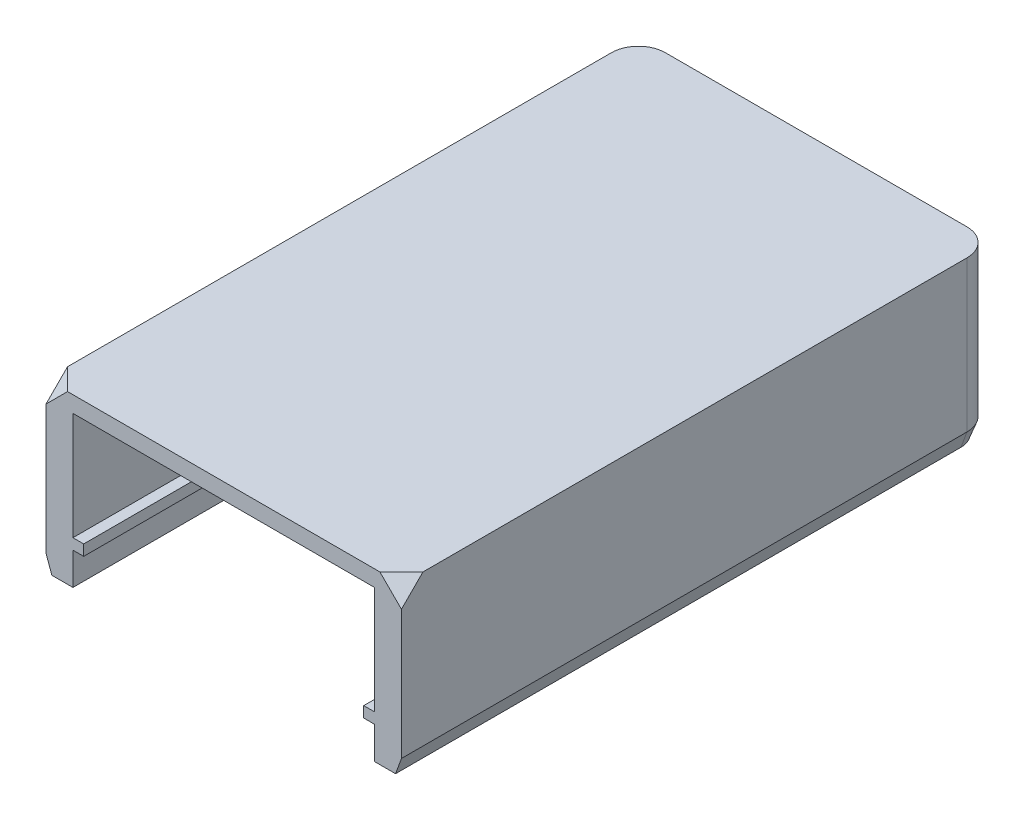
ISO-10303-21;
HEADER;
FILE_DESCRIPTION(('STEP AP214'),'2;1');
FILE_NAME('part.step','',(''),(''),'','','');
FILE_SCHEMA(('AUTOMOTIVE_DESIGN { 1 0 10303 214 1 1 1 1 }'));
ENDSEC;
DATA;
#1=APPLICATION_CONTEXT('core data for automotive mechanical design processes');
#2=APPLICATION_PROTOCOL_DEFINITION('international standard','automotive_design',2000,#1);
#3=PRODUCT_CONTEXT('',#1,'mechanical');
#4=PRODUCT('Part','Part','',(#3));
#5=PRODUCT_RELATED_PRODUCT_CATEGORY('part','',(#4));
#6=PRODUCT_DEFINITION_FORMATION('','',#4);
#7=PRODUCT_DEFINITION_CONTEXT('part definition',#1,'design');
#8=PRODUCT_DEFINITION('design','',#6,#7);
#9=PRODUCT_DEFINITION_SHAPE('','',#8);
#10=(LENGTH_UNIT() NAMED_UNIT(*) SI_UNIT(.MILLI.,.METRE.));
#11=(NAMED_UNIT(*) PLANE_ANGLE_UNIT() SI_UNIT($,.RADIAN.));
#12=(NAMED_UNIT(*) SI_UNIT($,.STERADIAN.) SOLID_ANGLE_UNIT());
#13=UNCERTAINTY_MEASURE_WITH_UNIT(LENGTH_MEASURE(1.E-05),#10,'distance_accuracy_value','');
#14=(GEOMETRIC_REPRESENTATION_CONTEXT(3) GLOBAL_UNCERTAINTY_ASSIGNED_CONTEXT((#13)) GLOBAL_UNIT_ASSIGNED_CONTEXT((#10,
#11,#12)) REPRESENTATION_CONTEXT('',''));
#15=CARTESIAN_POINT('',(0.,0.,0.));
#16=DIRECTION('',(0.,0.,1.));
#17=DIRECTION('',(1.,0.,0.));
#18=AXIS2_PLACEMENT_3D('',#15,#16,#17);
#19=CARTESIAN_POINT('',(28.,-28.,0.));
#20=DIRECTION('',(1.,0.,0.));
#21=DIRECTION('',(0.,0.,-1.));
#22=AXIS2_PLACEMENT_3D('',#19,#20,#21);
#23=PLANE('',#22);
#24=DIRECTION('',(0.,1.,0.));
#25=VECTOR('',#24,1.);
#26=CARTESIAN_POINT('',(28.,-28.,-52.));
#27=LINE('',#26,#25);
#28=CARTESIAN_POINT('',(28.,-20.,-52.));
#29=VERTEX_POINT('',#28);
#30=CARTESIAN_POINT('',(28.,0.,-52.));
#31=VERTEX_POINT('',#30);
#32=EDGE_CURVE('E338',#29,#31,#27,.T.);
#33=ORIENTED_EDGE('',*,*,#32,.F.);
#34=DIRECTION('',(0.,0.,1.));
#35=VECTOR('',#34,1.);
#36=CARTESIAN_POINT('',(28.,-20.,55.));
#37=LINE('',#36,#35);
#38=CARTESIAN_POINT('',(28.,-20.,55.));
#39=VERTEX_POINT('',#38);
#40=EDGE_CURVE('E231',#29,#39,#37,.T.);
#41=ORIENTED_EDGE('',*,*,#40,.T.);
#42=DIRECTION('',(0.,1.,0.));
#43=VECTOR('',#42,1.);
#44=CARTESIAN_POINT('',(28.,-28.,55.));
#45=LINE('',#44,#43);
#46=CARTESIAN_POINT('',(28.,0.,55.));
#47=VERTEX_POINT('',#46);
#48=EDGE_CURVE('E333',#39,#47,#45,.T.);
#49=ORIENTED_EDGE('',*,*,#48,.T.);
#50=DIRECTION('',(0.,0.,-1.));
#51=VECTOR('',#50,1.);
#52=CARTESIAN_POINT('',(28.,0.,0.));
#53=LINE('',#52,#51);
#54=EDGE_CURVE('E339',#47,#31,#53,.T.);
#55=ORIENTED_EDGE('',*,*,#54,.T.);
#56=EDGE_LOOP('',(#33,#41,#49,#55));
#57=FACE_BOUND('',#56,.T.);
#58=ADVANCED_FACE('F44',(#57),#23,.F.);
#59=CARTESIAN_POINT('',(0.,-28.,-52.));
#60=DIRECTION('',(0.,0.,1.));
#61=DIRECTION('',(1.,0.,0.));
#62=AXIS2_PLACEMENT_3D('',#59,#60,#61);
#63=PLANE('',#62);
#64=DIRECTION('',(1.,0.,0.));
#65=VECTOR('',#64,1.);
#66=CARTESIAN_POINT('',(26.,-20.,-52.));
#67=LINE('',#66,#65);
#68=CARTESIAN_POINT('',(26.,-20.,-52.));
#69=VERTEX_POINT('',#68);
#70=EDGE_CURVE('E403',#69,#29,#67,.T.);
#71=ORIENTED_EDGE('',*,*,#70,.T.);
#72=ORIENTED_EDGE('',*,*,#32,.T.);
#73=DIRECTION('',(1.,0.,0.));
#74=VECTOR('',#73,1.);
#75=CARTESIAN_POINT('',(0.,0.,-52.));
#76=LINE('',#75,#74);
#77=CARTESIAN_POINT('',(-28.,0.,-52.));
#78=VERTEX_POINT('',#77);
#79=EDGE_CURVE('E348',#78,#31,#76,.T.);
#80=ORIENTED_EDGE('',*,*,#79,.F.);
#81=DIRECTION('',(0.,1.,0.));
#82=VECTOR('',#81,1.);
#83=CARTESIAN_POINT('',(-28.,-28.,-52.));
#84=LINE('',#83,#82);
#85=CARTESIAN_POINT('',(-28.,-20.,-52.));
#86=VERTEX_POINT('',#85);
#87=EDGE_CURVE('E323',#86,#78,#84,.T.);
#88=ORIENTED_EDGE('',*,*,#87,.F.);
#89=DIRECTION('',(-1.,0.,0.));
#90=VECTOR('',#89,1.);
#91=CARTESIAN_POINT('',(-26.,-20.,-52.));
#92=LINE('',#91,#90);
#93=CARTESIAN_POINT('',(-26.,-20.,-52.));
#94=VERTEX_POINT('',#93);
#95=EDGE_CURVE('E374',#94,#86,#92,.T.);
#96=ORIENTED_EDGE('',*,*,#95,.F.);
#97=DIRECTION('',(0.,1.,0.));
#98=VECTOR('',#97,1.);
#99=CARTESIAN_POINT('',(-26.,-22.,-52.));
#100=LINE('',#99,#98);
#101=CARTESIAN_POINT('',(-26.,-22.,-52.));
#102=VERTEX_POINT('',#101);
#103=EDGE_CURVE('E392',#102,#94,#100,.T.);
#104=ORIENTED_EDGE('',*,*,#103,.F.);
#105=DIRECTION('',(-1.,0.,0.));
#106=VECTOR('',#105,1.);
#107=CARTESIAN_POINT('',(-26.,-22.,-52.));
#108=LINE('',#107,#106);
#109=CARTESIAN_POINT('',(-28.,-22.,-52.));
#110=VERTEX_POINT('',#109);
#111=EDGE_CURVE('E370',#102,#110,#108,.T.);
#112=ORIENTED_EDGE('',*,*,#111,.T.);
#113=CARTESIAN_POINT('',(-28.,-28.,-52.));
#114=VERTEX_POINT('',#113);
#115=EDGE_CURVE('E310',#114,#110,#84,.T.);
#116=ORIENTED_EDGE('',*,*,#115,.F.);
#117=DIRECTION('',(1.,0.,0.));
#118=VECTOR('',#117,1.);
#119=CARTESIAN_POINT('',(0.,-28.,-52.));
#120=LINE('',#119,#118);
#121=CARTESIAN_POINT('',(28.,-28.,-52.));
#122=VERTEX_POINT('',#121);
#123=EDGE_CURVE('E343',#114,#122,#120,.T.);
#124=ORIENTED_EDGE('',*,*,#123,.T.);
#125=CARTESIAN_POINT('',(28.,-22.,-52.));
#126=VERTEX_POINT('',#125);
#127=EDGE_CURVE('E334',#122,#126,#27,.T.);
#128=ORIENTED_EDGE('',*,*,#127,.T.);
#129=DIRECTION('',(1.,0.,0.));
#130=VECTOR('',#129,1.);
#131=CARTESIAN_POINT('',(26.,-22.,-52.));
#132=LINE('',#131,#130);
#133=CARTESIAN_POINT('',(26.,-22.,-52.));
#134=VERTEX_POINT('',#133);
#135=EDGE_CURVE('E407',#134,#126,#132,.T.);
#136=ORIENTED_EDGE('',*,*,#135,.F.);
#137=DIRECTION('',(0.,1.,0.));
#138=VECTOR('',#137,1.);
#139=CARTESIAN_POINT('',(26.,-22.,-52.));
#140=LINE('',#139,#138);
#141=EDGE_CURVE('E425',#134,#69,#140,.T.);
#142=ORIENTED_EDGE('',*,*,#141,.T.);
#143=EDGE_LOOP('',(#71,#72,#80,#88,#96,#104,#112,#116,#124,#128,#136,#142));
#144=FACE_BOUND('',#143,.T.);
#145=ADVANCED_FACE('F447',(#144),#63,.T.);
#146=CARTESIAN_POINT('',(-28.,-28.,0.));
#147=DIRECTION('',(1.,0.,0.));
#148=DIRECTION('',(0.,0.,-1.));
#149=AXIS2_PLACEMENT_3D('',#146,#147,#148);
#150=PLANE('',#149);
#151=ORIENTED_EDGE('',*,*,#115,.T.);
#152=DIRECTION('',(0.,0.,-1.));
#153=VECTOR('',#152,1.);
#154=CARTESIAN_POINT('',(-28.,-22.,55.));
#155=LINE('',#154,#153);
#156=CARTESIAN_POINT('',(-28.,-22.,55.));
#157=VERTEX_POINT('',#156);
#158=EDGE_CURVE('E386',#157,#110,#155,.T.);
#159=ORIENTED_EDGE('',*,*,#158,.F.);
#160=DIRECTION('',(0.,1.,0.));
#161=VECTOR('',#160,1.);
#162=CARTESIAN_POINT('',(-28.,-28.,55.));
#163=LINE('',#162,#161);
#164=CARTESIAN_POINT('',(-28.,-28.,55.));
#165=VERTEX_POINT('',#164);
#166=EDGE_CURVE('E324',#165,#157,#163,.T.);
#167=ORIENTED_EDGE('',*,*,#166,.F.);
#168=DIRECTION('',(0.,0.,-1.));
#169=VECTOR('',#168,1.);
#170=CARTESIAN_POINT('',(-28.,-28.,0.));
#171=LINE('',#170,#169);
#172=EDGE_CURVE('E361',#165,#114,#171,.T.);
#173=ORIENTED_EDGE('',*,*,#172,.T.);
#174=EDGE_LOOP('',(#151,#159,#167,#173));
#175=FACE_BOUND('',#174,.T.);
#176=ADVANCED_FACE('F503',(#175),#150,.T.);
#177=CARTESIAN_POINT('',(-28.,-20.,55.));
#178=VERTEX_POINT('',#177);
#179=CARTESIAN_POINT('',(-28.,0.,55.));
#180=VERTEX_POINT('',#179);
#181=EDGE_CURVE('E328',#178,#180,#163,.T.);
#182=ORIENTED_EDGE('',*,*,#181,.F.);
#183=DIRECTION('',(0.,0.,1.));
#184=VECTOR('',#183,1.);
#185=CARTESIAN_POINT('',(-28.,-20.,55.));
#186=LINE('',#185,#184);
#187=EDGE_CURVE('E382',#86,#178,#186,.T.);
#188=ORIENTED_EDGE('',*,*,#187,.F.);
#189=ORIENTED_EDGE('',*,*,#87,.T.);
#190=DIRECTION('',(0.,0.,-1.));
#191=VECTOR('',#190,1.);
#192=CARTESIAN_POINT('',(-28.,0.,0.));
#193=LINE('',#192,#191);
#194=EDGE_CURVE('E344',#180,#78,#193,.T.);
#195=ORIENTED_EDGE('',*,*,#194,.F.);
#196=EDGE_LOOP('',(#182,#188,#189,#195));
#197=FACE_BOUND('',#196,.T.);
#198=ADVANCED_FACE('F522',(#197),#150,.T.);
#199=CARTESIAN_POINT('',(33.,3.,55.));
#200=DIRECTION('',(-1.,0.,0.));
#201=DIRECTION('',(0.,0.,1.));
#202=AXIS2_PLACEMENT_3D('',#199,#200,#201);
#203=PLANE('',#202);
#204=DIRECTION('',(0.,0.707106781186548,-0.707106781186547));
#205=VECTOR('',#204,1.);
#206=CARTESIAN_POINT('',(33.,1.,53.));
#207=LINE('',#206,#205);
#208=CARTESIAN_POINT('',(33.,-1.,55.));
#209=VERTEX_POINT('',#208);
#210=CARTESIAN_POINT('',(33.,3.,51.));
#211=VERTEX_POINT('',#210);
#212=EDGE_CURVE('E66',#209,#211,#207,.T.);
#213=ORIENTED_EDGE('',*,*,#212,.F.);
#214=DIRECTION('',(0.,-1.,0.));
#215=VECTOR('',#214,1.);
#216=CARTESIAN_POINT('',(33.,3.,55.));
#217=LINE('',#216,#215);
#218=CARTESIAN_POINT('',(33.,-25.,55.));
#219=VERTEX_POINT('',#218);
#220=EDGE_CURVE('E205',#209,#219,#217,.T.);
#221=ORIENTED_EDGE('',*,*,#220,.T.);
#222=DIRECTION('',(0.,0.,-1.));
#223=VECTOR('',#222,1.);
#224=CARTESIAN_POINT('',(33.,-25.,-50.));
#225=LINE('',#224,#223);
#226=CARTESIAN_POINT('',(33.,-25.,-50.));
#227=VERTEX_POINT('',#226);
#228=EDGE_CURVE('E226',#219,#227,#225,.T.);
#229=ORIENTED_EDGE('',*,*,#228,.T.);
#230=DIRECTION('',(0.,-1.,0.));
#231=VECTOR('',#230,1.);
#232=CARTESIAN_POINT('',(33.,3.,-50.));
#233=LINE('',#232,#231);
#234=CARTESIAN_POINT('',(33.,3.,-50.));
#235=VERTEX_POINT('',#234);
#236=EDGE_CURVE('E280',#227,#235,#233,.F.);
#237=ORIENTED_EDGE('',*,*,#236,.T.);
#238=DIRECTION('',(0.,0.,-1.));
#239=VECTOR('',#238,1.);
#240=CARTESIAN_POINT('',(33.,3.,55.));
#241=LINE('',#240,#239);
#242=EDGE_CURVE('E309',#211,#235,#241,.T.);
#243=ORIENTED_EDGE('',*,*,#242,.F.);
#244=EDGE_LOOP('',(#213,#221,#229,#237,#243));
#245=FACE_BOUND('',#244,.T.);
#246=ADVANCED_FACE('F463',(#245),#203,.F.);
#247=CARTESIAN_POINT('',(-33.,3.,-55.));
#248=DIRECTION('',(0.,0.,1.));
#249=DIRECTION('',(1.,0.,0.));
#250=AXIS2_PLACEMENT_3D('',#247,#248,#249);
#251=PLANE('',#250);
#252=DIRECTION('',(0.,-1.,0.));
#253=VECTOR('',#252,1.);
#254=CARTESIAN_POINT('',(28.,3.,-55.));
#255=LINE('',#254,#253);
#256=CARTESIAN_POINT('',(28.,3.,-55.));
#257=VERTEX_POINT('',#256);
#258=CARTESIAN_POINT('',(28.,-25.,-55.));
#259=VERTEX_POINT('',#258);
#260=EDGE_CURVE('E293',#257,#259,#255,.T.);
#261=ORIENTED_EDGE('',*,*,#260,.T.);
#262=DIRECTION('',(-1.,0.,0.));
#263=VECTOR('',#262,1.);
#264=CARTESIAN_POINT('',(-28.,-25.,-55.));
#265=LINE('',#264,#263);
#266=CARTESIAN_POINT('',(-28.,-25.,-55.));
#267=VERTEX_POINT('',#266);
#268=EDGE_CURVE('E248',#259,#267,#265,.T.);
#269=ORIENTED_EDGE('',*,*,#268,.T.);
#270=DIRECTION('',(0.,-1.,0.));
#271=VECTOR('',#270,1.);
#272=CARTESIAN_POINT('',(-28.,3.,-55.));
#273=LINE('',#272,#271);
#274=CARTESIAN_POINT('',(-28.,3.,-55.));
#275=VERTEX_POINT('',#274);
#276=EDGE_CURVE('E290',#267,#275,#273,.F.);
#277=ORIENTED_EDGE('',*,*,#276,.T.);
#278=DIRECTION('',(-1.,0.,0.));
#279=VECTOR('',#278,1.);
#280=CARTESIAN_POINT('',(-33.,3.,-55.));
#281=LINE('',#280,#279);
#282=EDGE_CURVE('E314',#257,#275,#281,.T.);
#283=ORIENTED_EDGE('',*,*,#282,.F.);
#284=EDGE_LOOP('',(#261,#269,#277,#283));
#285=FACE_BOUND('',#284,.T.);
#286=ADVANCED_FACE('F471',(#285),#251,.F.);
#287=CARTESIAN_POINT('',(-33.,3.,55.));
#288=DIRECTION('',(1.,0.,0.));
#289=DIRECTION('',(0.,0.,-1.));
#290=AXIS2_PLACEMENT_3D('',#287,#288,#289);
#291=PLANE('',#290);
#292=DIRECTION('',(0.,-0.707106781186548,0.707106781186547));
#293=VECTOR('',#292,1.);
#294=CARTESIAN_POINT('',(-33.,1.00000000000001,53.));
#295=LINE('',#294,#293);
#296=CARTESIAN_POINT('',(-33.,3.,51.));
#297=VERTEX_POINT('',#296);
#298=CARTESIAN_POINT('',(-33.,-0.999999999999982,55.));
#299=VERTEX_POINT('',#298);
#300=EDGE_CURVE('E222',#297,#299,#295,.T.);
#301=ORIENTED_EDGE('',*,*,#300,.F.);
#302=DIRECTION('',(0.,0.,1.));
#303=VECTOR('',#302,1.);
#304=CARTESIAN_POINT('',(-33.,3.,55.));
#305=LINE('',#304,#303);
#306=CARTESIAN_POINT('',(-33.,3.,-50.));
#307=VERTEX_POINT('',#306);
#308=EDGE_CURVE('E206',#307,#297,#305,.T.);
#309=ORIENTED_EDGE('',*,*,#308,.F.);
#310=DIRECTION('',(0.,-1.,0.));
#311=VECTOR('',#310,1.);
#312=CARTESIAN_POINT('',(-33.,3.,-50.));
#313=LINE('',#312,#311);
#314=CARTESIAN_POINT('',(-33.,-25.,-50.));
#315=VERTEX_POINT('',#314);
#316=EDGE_CURVE('E297',#307,#315,#313,.T.);
#317=ORIENTED_EDGE('',*,*,#316,.T.);
#318=DIRECTION('',(0.,0.,1.));
#319=VECTOR('',#318,1.);
#320=CARTESIAN_POINT('',(-33.,-25.,55.));
#321=LINE('',#320,#319);
#322=CARTESIAN_POINT('',(-33.,-25.,55.));
#323=VERTEX_POINT('',#322);
#324=EDGE_CURVE('E260',#315,#323,#321,.T.);
#325=ORIENTED_EDGE('',*,*,#324,.T.);
#326=DIRECTION('',(0.,-1.,0.));
#327=VECTOR('',#326,1.);
#328=CARTESIAN_POINT('',(-33.,3.,55.));
#329=LINE('',#328,#327);
#330=EDGE_CURVE('E301',#299,#323,#329,.T.);
#331=ORIENTED_EDGE('',*,*,#330,.F.);
#332=EDGE_LOOP('',(#301,#309,#317,#325,#331));
#333=FACE_BOUND('',#332,.T.);
#334=ADVANCED_FACE('F495',(#333),#291,.F.);
#335=CARTESIAN_POINT('',(-33.,3.,55.));
#336=DIRECTION('',(0.,0.,-1.));
#337=DIRECTION('',(-1.,0.,0.));
#338=AXIS2_PLACEMENT_3D('',#335,#336,#337);
#339=PLANE('',#338);
#340=DIRECTION('',(0.707106781186547,-0.707106781186548,0.));
#341=VECTOR('',#340,1.);
#342=CARTESIAN_POINT('',(-2.,34.,55.));
#343=LINE('',#342,#341);
#344=CARTESIAN_POINT('',(29.,3.,55.));
#345=VERTEX_POINT('',#344);
#346=EDGE_CURVE('E54',#345,#209,#343,.T.);
#347=ORIENTED_EDGE('',*,*,#346,.F.);
#348=DIRECTION('',(1.,0.,0.));
#349=VECTOR('',#348,1.);
#350=CARTESIAN_POINT('',(-33.,3.,55.));
#351=LINE('',#350,#349);
#352=CARTESIAN_POINT('',(-29.,3.,55.));
#353=VERTEX_POINT('',#352);
#354=EDGE_CURVE('E197',#353,#345,#351,.T.);
#355=ORIENTED_EDGE('',*,*,#354,.F.);
#356=DIRECTION('',(0.707106781186547,0.707106781186548,0.));
#357=VECTOR('',#356,1.);
#358=CARTESIAN_POINT('',(-31.,1.00000000000001,55.));
#359=LINE('',#358,#357);
#360=EDGE_CURVE('E217',#299,#353,#359,.T.);
#361=ORIENTED_EDGE('',*,*,#360,.F.);
#362=ORIENTED_EDGE('',*,*,#330,.T.);
#363=DIRECTION('',(0.342020143325667,-0.939692620785909,0.));
#364=VECTOR('',#363,1.);
#365=CARTESIAN_POINT('',(-31.9080892972014,-28.,55.));
#366=LINE('',#365,#364);
#367=CARTESIAN_POINT('',(-31.9080892972014,-28.,55.));
#368=VERTEX_POINT('',#367);
#369=EDGE_CURVE('E254',#323,#368,#366,.T.);
#370=ORIENTED_EDGE('',*,*,#369,.T.);
#371=DIRECTION('',(-1.,0.,0.));
#372=VECTOR('',#371,1.);
#373=CARTESIAN_POINT('',(0.,-28.,55.));
#374=LINE('',#373,#372);
#375=EDGE_CURVE('E357',#165,#368,#374,.T.);
#376=ORIENTED_EDGE('',*,*,#375,.F.);
#377=ORIENTED_EDGE('',*,*,#166,.T.);
#378=DIRECTION('',(-1.,0.,0.));
#379=VECTOR('',#378,1.);
#380=CARTESIAN_POINT('',(-26.,-22.,55.));
#381=LINE('',#380,#379);
#382=CARTESIAN_POINT('',(-26.,-22.,55.));
#383=VERTEX_POINT('',#382);
#384=EDGE_CURVE('E352',#383,#157,#381,.T.);
#385=ORIENTED_EDGE('',*,*,#384,.F.);
#386=DIRECTION('',(0.,-1.,0.));
#387=VECTOR('',#386,1.);
#388=CARTESIAN_POINT('',(-26.,-22.,55.));
#389=LINE('',#388,#387);
#390=CARTESIAN_POINT('',(-26.,-20.,55.));
#391=VERTEX_POINT('',#390);
#392=EDGE_CURVE('E385',#391,#383,#389,.T.);
#393=ORIENTED_EDGE('',*,*,#392,.F.);
#394=DIRECTION('',(-1.,0.,0.));
#395=VECTOR('',#394,1.);
#396=CARTESIAN_POINT('',(-26.,-20.,55.));
#397=LINE('',#396,#395);
#398=EDGE_CURVE('E377',#391,#178,#397,.T.);
#399=ORIENTED_EDGE('',*,*,#398,.T.);
#400=ORIENTED_EDGE('',*,*,#181,.T.);
#401=DIRECTION('',(1.,0.,0.));
#402=VECTOR('',#401,1.);
#403=CARTESIAN_POINT('',(-33.,0.,55.));
#404=LINE('',#403,#402);
#405=EDGE_CURVE('E306',#180,#47,#404,.T.);
#406=ORIENTED_EDGE('',*,*,#405,.T.);
#407=ORIENTED_EDGE('',*,*,#48,.F.);
#408=DIRECTION('',(1.,0.,0.));
#409=VECTOR('',#408,1.);
#410=CARTESIAN_POINT('',(26.,-20.,55.));
#411=LINE('',#410,#409);
#412=CARTESIAN_POINT('',(26.,-20.,55.));
#413=VERTEX_POINT('',#412);
#414=EDGE_CURVE('E389',#413,#39,#411,.T.);
#415=ORIENTED_EDGE('',*,*,#414,.F.);
#416=DIRECTION('',(0.,-1.,0.));
#417=VECTOR('',#416,1.);
#418=CARTESIAN_POINT('',(26.,-22.,55.));
#419=LINE('',#418,#417);
#420=CARTESIAN_POINT('',(26.,-22.,55.));
#421=VERTEX_POINT('',#420);
#422=EDGE_CURVE('E418',#413,#421,#419,.T.);
#423=ORIENTED_EDGE('',*,*,#422,.T.);
#424=DIRECTION('',(1.,0.,0.));
#425=VECTOR('',#424,1.);
#426=CARTESIAN_POINT('',(26.,-22.,55.));
#427=LINE('',#426,#425);
#428=CARTESIAN_POINT('',(28.,-22.,55.));
#429=VERTEX_POINT('',#428);
#430=EDGE_CURVE('E410',#421,#429,#427,.T.);
#431=ORIENTED_EDGE('',*,*,#430,.T.);
#432=CARTESIAN_POINT('',(28.,-28.,55.));
#433=VERTEX_POINT('',#432);
#434=EDGE_CURVE('E329',#433,#429,#45,.T.);
#435=ORIENTED_EDGE('',*,*,#434,.F.);
#436=CARTESIAN_POINT('',(31.9080892972014,-28.,55.));
#437=VERTEX_POINT('',#436);
#438=EDGE_CURVE('E356',#437,#433,#374,.T.);
#439=ORIENTED_EDGE('',*,*,#438,.F.);
#440=DIRECTION('',(0.342020143325667,0.939692620785909,0.));
#441=VECTOR('',#440,1.);
#442=CARTESIAN_POINT('',(31.9080892972014,-28.,55.));
#443=LINE('',#442,#441);
#444=EDGE_CURVE('E257',#437,#219,#443,.T.);
#445=ORIENTED_EDGE('',*,*,#444,.T.);
#446=ORIENTED_EDGE('',*,*,#220,.F.);
#447=EDGE_LOOP('',(#347,#355,#361,#362,#370,#376,#377,#385,#393,#399,#400,#406,#407,#415,#423,
#431,#435,#439,#445,#446));
#448=FACE_BOUND('',#447,.T.);
#449=ADVANCED_FACE('F209',(#448),#339,.F.);
#450=CARTESIAN_POINT('',(0.,3.,0.));
#451=DIRECTION('',(0.,-1.,0.));
#452=DIRECTION('',(0.,0.,-1.));
#453=AXIS2_PLACEMENT_3D('',#450,#451,#452);
#454=PLANE('',#453);
#455=DIRECTION('',(-0.707106781186548,0.,0.707106781186547));
#456=VECTOR('',#455,1.);
#457=CARTESIAN_POINT('',(42.,3.,42.));
#458=LINE('',#457,#456);
#459=EDGE_CURVE('E11',#211,#345,#458,.T.);
#460=ORIENTED_EDGE('',*,*,#459,.F.);
#461=ORIENTED_EDGE('',*,*,#242,.T.);
#462=CARTESIAN_POINT('',(28.,3.,-50.));
#463=DIRECTION('',(0.,-1.,0.));
#464=DIRECTION('',(0.,0.,-1.));
#465=AXIS2_PLACEMENT_3D('',#462,#463,#464);
#466=CIRCLE('',#465,5.);
#467=EDGE_CURVE('E287',#235,#257,#466,.F.);
#468=ORIENTED_EDGE('',*,*,#467,.T.);
#469=ORIENTED_EDGE('',*,*,#282,.T.);
#470=CARTESIAN_POINT('',(-28.,3.,-50.));
#471=DIRECTION('',(0.,-1.,0.));
#472=DIRECTION('',(0.,0.,-1.));
#473=AXIS2_PLACEMENT_3D('',#470,#471,#472);
#474=CIRCLE('',#473,5.);
#475=EDGE_CURVE('E284',#275,#307,#474,.F.);
#476=ORIENTED_EDGE('',*,*,#475,.T.);
#477=ORIENTED_EDGE('',*,*,#308,.T.);
#478=DIRECTION('',(-0.707106781186548,0.,-0.707106781186547));
#479=VECTOR('',#478,1.);
#480=CARTESIAN_POINT('',(-42.,3.,42.));
#481=LINE('',#480,#479);
#482=EDGE_CURVE('E201',#353,#297,#481,.T.);
#483=ORIENTED_EDGE('',*,*,#482,.F.);
#484=ORIENTED_EDGE('',*,*,#354,.T.);
#485=EDGE_LOOP('',(#460,#461,#468,#469,#476,#477,#483,#484));
#486=FACE_BOUND('',#485,.T.);
#487=ADVANCED_FACE('F199',(#486),#454,.F.);
#488=CARTESIAN_POINT('',(0.,0.,0.));
#489=DIRECTION('',(0.,-1.,0.));
#490=DIRECTION('',(0.,0.,-1.));
#491=AXIS2_PLACEMENT_3D('',#488,#489,#490);
#492=PLANE('',#491);
#493=ORIENTED_EDGE('',*,*,#54,.F.);
#494=ORIENTED_EDGE('',*,*,#405,.F.);
#495=ORIENTED_EDGE('',*,*,#194,.T.);
#496=ORIENTED_EDGE('',*,*,#79,.T.);
#497=EDGE_LOOP('',(#493,#494,#495,#496));
#498=FACE_BOUND('',#497,.T.);
#499=ADVANCED_FACE('F534',(#498),#492,.T.);
#500=ORIENTED_EDGE('',*,*,#434,.T.);
#501=DIRECTION('',(0.,0.,-1.));
#502=VECTOR('',#501,1.);
#503=CARTESIAN_POINT('',(28.,-22.,55.));
#504=LINE('',#503,#502);
#505=EDGE_CURVE('E414',#429,#126,#504,.T.);
#506=ORIENTED_EDGE('',*,*,#505,.T.);
#507=ORIENTED_EDGE('',*,*,#127,.F.);
#508=DIRECTION('',(0.,0.,-1.));
#509=VECTOR('',#508,1.);
#510=CARTESIAN_POINT('',(28.,-28.,0.));
#511=LINE('',#510,#509);
#512=EDGE_CURVE('E353',#433,#122,#511,.T.);
#513=ORIENTED_EDGE('',*,*,#512,.F.);
#514=EDGE_LOOP('',(#500,#506,#507,#513));
#515=FACE_BOUND('',#514,.T.);
#516=ADVANCED_FACE('F452',(#515),#23,.F.);
#517=CARTESIAN_POINT('',(0.,-28.,0.));
#518=DIRECTION('',(0.,-1.,0.));
#519=DIRECTION('',(0.,0.,-1.));
#520=AXIS2_PLACEMENT_3D('',#517,#518,#519);
#521=PLANE('',#520);
#522=ORIENTED_EDGE('',*,*,#375,.T.);
#523=DIRECTION('',(0.,0.,-1.));
#524=VECTOR('',#523,1.);
#525=CARTESIAN_POINT('',(-31.9080892972014,-28.,-50.));
#526=LINE('',#525,#524);
#527=CARTESIAN_POINT('',(-31.9080892972014,-28.,-50.));
#528=VERTEX_POINT('',#527);
#529=EDGE_CURVE('E264',#368,#528,#526,.T.);
#530=ORIENTED_EDGE('',*,*,#529,.T.);
#531=CARTESIAN_POINT('',(-28.,-28.,-50.));
#532=DIRECTION('',(0.,-1.,0.));
#533=DIRECTION('',(0.,0.,-1.));
#534=AXIS2_PLACEMENT_3D('',#531,#532,#533);
#535=CIRCLE('',#534,3.90808929720139);
#536=CARTESIAN_POINT('',(-28.,-28.,-53.9080892972014));
#537=VERTEX_POINT('',#536);
#538=EDGE_CURVE('E268',#528,#537,#535,.T.);
#539=ORIENTED_EDGE('',*,*,#538,.T.);
#540=DIRECTION('',(1.,0.,0.));
#541=VECTOR('',#540,1.);
#542=CARTESIAN_POINT('',(28.,-28.,-53.9080892972014));
#543=LINE('',#542,#541);
#544=CARTESIAN_POINT('',(28.,-28.,-53.9080892972014));
#545=VERTEX_POINT('',#544);
#546=EDGE_CURVE('E271',#537,#545,#543,.T.);
#547=ORIENTED_EDGE('',*,*,#546,.T.);
#548=CARTESIAN_POINT('',(28.,-28.,-50.));
#549=DIRECTION('',(0.,-1.,0.));
#550=DIRECTION('',(0.,0.,-1.));
#551=AXIS2_PLACEMENT_3D('',#548,#549,#550);
#552=CIRCLE('',#551,3.90808929720139);
#553=CARTESIAN_POINT('',(31.9080892972014,-28.,-50.));
#554=VERTEX_POINT('',#553);
#555=EDGE_CURVE('E274',#545,#554,#552,.T.);
#556=ORIENTED_EDGE('',*,*,#555,.T.);
#557=DIRECTION('',(0.,0.,1.));
#558=VECTOR('',#557,1.);
#559=CARTESIAN_POINT('',(31.9080892972014,-28.,55.));
#560=LINE('',#559,#558);
#561=EDGE_CURVE('E277',#554,#437,#560,.T.);
#562=ORIENTED_EDGE('',*,*,#561,.T.);
#563=ORIENTED_EDGE('',*,*,#438,.T.);
#564=ORIENTED_EDGE('',*,*,#512,.T.);
#565=ORIENTED_EDGE('',*,*,#123,.F.);
#566=ORIENTED_EDGE('',*,*,#172,.F.);
#567=EDGE_LOOP('',(#522,#530,#539,#547,#556,#562,#563,#564,#565,#566));
#568=FACE_BOUND('',#567,.T.);
#569=ADVANCED_FACE('F501',(#568),#521,.T.);
#570=CARTESIAN_POINT('',(-26.,-22.,55.));
#571=DIRECTION('',(0.,1.,0.));
#572=DIRECTION('',(0.,0.,1.));
#573=AXIS2_PLACEMENT_3D('',#570,#571,#572);
#574=PLANE('',#573);
#575=ORIENTED_EDGE('',*,*,#158,.T.);
#576=ORIENTED_EDGE('',*,*,#111,.F.);
#577=DIRECTION('',(0.,0.,-1.));
#578=VECTOR('',#577,1.);
#579=CARTESIAN_POINT('',(-26.,-22.,55.));
#580=LINE('',#579,#578);
#581=EDGE_CURVE('E395',#383,#102,#580,.T.);
#582=ORIENTED_EDGE('',*,*,#581,.F.);
#583=ORIENTED_EDGE('',*,*,#384,.T.);
#584=EDGE_LOOP('',(#575,#576,#582,#583));
#585=FACE_BOUND('',#584,.T.);
#586=ADVANCED_FACE('F508',(#585),#574,.F.);
#587=CARTESIAN_POINT('',(-26.,-20.,55.));
#588=DIRECTION('',(0.,-1.,0.));
#589=DIRECTION('',(0.,0.,-1.));
#590=AXIS2_PLACEMENT_3D('',#587,#588,#589);
#591=PLANE('',#590);
#592=ORIENTED_EDGE('',*,*,#187,.T.);
#593=ORIENTED_EDGE('',*,*,#398,.F.);
#594=DIRECTION('',(0.,0.,1.));
#595=VECTOR('',#594,1.);
#596=CARTESIAN_POINT('',(-26.,-20.,55.));
#597=LINE('',#596,#595);
#598=EDGE_CURVE('E381',#94,#391,#597,.T.);
#599=ORIENTED_EDGE('',*,*,#598,.F.);
#600=ORIENTED_EDGE('',*,*,#95,.T.);
#601=EDGE_LOOP('',(#592,#593,#599,#600));
#602=FACE_BOUND('',#601,.T.);
#603=ADVANCED_FACE('F517',(#602),#591,.F.);
#604=CARTESIAN_POINT('',(-26.,0.,0.));
#605=DIRECTION('',(-1.,0.,0.));
#606=DIRECTION('',(0.,0.,1.));
#607=AXIS2_PLACEMENT_3D('',#604,#605,#606);
#608=PLANE('',#607);
#609=ORIENTED_EDGE('',*,*,#392,.T.);
#610=ORIENTED_EDGE('',*,*,#581,.T.);
#611=ORIENTED_EDGE('',*,*,#103,.T.);
#612=ORIENTED_EDGE('',*,*,#598,.T.);
#613=EDGE_LOOP('',(#609,#610,#611,#612));
#614=FACE_BOUND('',#613,.T.);
#615=ADVANCED_FACE('F512',(#614),#608,.F.);
#616=CARTESIAN_POINT('',(26.,-20.,55.));
#617=DIRECTION('',(0.,1.,0.));
#618=DIRECTION('',(0.,0.,1.));
#619=AXIS2_PLACEMENT_3D('',#616,#617,#618);
#620=PLANE('',#619);
#621=ORIENTED_EDGE('',*,*,#40,.F.);
#622=ORIENTED_EDGE('',*,*,#70,.F.);
#623=DIRECTION('',(0.,0.,1.));
#624=VECTOR('',#623,1.);
#625=CARTESIAN_POINT('',(26.,-20.,55.));
#626=LINE('',#625,#624);
#627=EDGE_CURVE('E429',#69,#413,#626,.T.);
#628=ORIENTED_EDGE('',*,*,#627,.T.);
#629=ORIENTED_EDGE('',*,*,#414,.T.);
#630=EDGE_LOOP('',(#621,#622,#628,#629));
#631=FACE_BOUND('',#630,.T.);
#632=ADVANCED_FACE('F618',(#631),#620,.T.);
#633=CARTESIAN_POINT('',(26.,-22.,55.));
#634=DIRECTION('',(0.,-1.,0.));
#635=DIRECTION('',(0.,0.,-1.));
#636=AXIS2_PLACEMENT_3D('',#633,#634,#635);
#637=PLANE('',#636);
#638=ORIENTED_EDGE('',*,*,#505,.F.);
#639=ORIENTED_EDGE('',*,*,#430,.F.);
#640=DIRECTION('',(0.,0.,-1.));
#641=VECTOR('',#640,1.);
#642=CARTESIAN_POINT('',(26.,-22.,55.));
#643=LINE('',#642,#641);
#644=EDGE_CURVE('E413',#421,#134,#643,.T.);
#645=ORIENTED_EDGE('',*,*,#644,.T.);
#646=ORIENTED_EDGE('',*,*,#135,.T.);
#647=EDGE_LOOP('',(#638,#639,#645,#646));
#648=FACE_BOUND('',#647,.T.);
#649=ADVANCED_FACE('F445',(#648),#637,.T.);
#650=CARTESIAN_POINT('',(26.,0.,0.));
#651=DIRECTION('',(1.,0.,0.));
#652=DIRECTION('',(0.,0.,1.));
#653=AXIS2_PLACEMENT_3D('',#650,#651,#652);
#654=PLANE('',#653);
#655=ORIENTED_EDGE('',*,*,#422,.F.);
#656=ORIENTED_EDGE('',*,*,#627,.F.);
#657=ORIENTED_EDGE('',*,*,#141,.F.);
#658=ORIENTED_EDGE('',*,*,#644,.F.);
#659=EDGE_LOOP('',(#655,#656,#657,#658));
#660=FACE_BOUND('',#659,.T.);
#661=ADVANCED_FACE('F442',(#660),#654,.F.);
#662=CARTESIAN_POINT('',(-28.,3.,-50.));
#663=DIRECTION('',(0.,-1.,0.));
#664=DIRECTION('',(0.,0.,-1.));
#665=AXIS2_PLACEMENT_3D('',#662,#663,#664);
#666=CYLINDRICAL_SURFACE('',#665,5.);
#667=ORIENTED_EDGE('',*,*,#276,.F.);
#668=CARTESIAN_POINT('',(-28.,-25.,-50.));
#669=DIRECTION('',(0.,-1.,0.));
#670=DIRECTION('',(0.,0.,-1.));
#671=AXIS2_PLACEMENT_3D('',#668,#669,#670);
#672=CIRCLE('',#671,5.);
#673=EDGE_CURVE('E251',#267,#315,#672,.F.);
#674=ORIENTED_EDGE('',*,*,#673,.T.);
#675=ORIENTED_EDGE('',*,*,#316,.F.);
#676=ORIENTED_EDGE('',*,*,#475,.F.);
#677=EDGE_LOOP('',(#667,#674,#675,#676));
#678=FACE_BOUND('',#677,.T.);
#679=ADVANCED_FACE('F477',(#678),#666,.T.);
#680=CARTESIAN_POINT('',(28.,3.,-50.));
#681=DIRECTION('',(0.,-1.,0.));
#682=DIRECTION('',(0.,0.,-1.));
#683=AXIS2_PLACEMENT_3D('',#680,#681,#682);
#684=CYLINDRICAL_SURFACE('',#683,5.);
#685=ORIENTED_EDGE('',*,*,#236,.F.);
#686=CARTESIAN_POINT('',(28.,-25.,-50.));
#687=DIRECTION('',(0.,-1.,0.));
#688=DIRECTION('',(0.,0.,-1.));
#689=AXIS2_PLACEMENT_3D('',#686,#687,#688);
#690=CIRCLE('',#689,5.);
#691=EDGE_CURVE('E245',#227,#259,#690,.F.);
#692=ORIENTED_EDGE('',*,*,#691,.T.);
#693=ORIENTED_EDGE('',*,*,#260,.F.);
#694=ORIENTED_EDGE('',*,*,#467,.F.);
#695=EDGE_LOOP('',(#685,#692,#693,#694));
#696=FACE_BOUND('',#695,.T.);
#697=ADVANCED_FACE('F466',(#696),#684,.T.);
#698=CARTESIAN_POINT('',(31.9080892972014,-28.,0.));
#699=DIRECTION('',(0.939692620785909,-0.342020143325667,0.));
#700=DIRECTION('',(0.,0.,-1.));
#701=AXIS2_PLACEMENT_3D('',#698,#699,#700);
#702=PLANE('',#701);
#703=ORIENTED_EDGE('',*,*,#444,.F.);
#704=ORIENTED_EDGE('',*,*,#561,.F.);
#705=DIRECTION('',(-0.342020143325667,-0.939692620785909,0.));
#706=VECTOR('',#705,1.);
#707=CARTESIAN_POINT('',(33.,-25.,-50.));
#708=LINE('',#707,#706);
#709=EDGE_CURVE('E227',#227,#554,#708,.T.);
#710=ORIENTED_EDGE('',*,*,#709,.F.);
#711=ORIENTED_EDGE('',*,*,#228,.F.);
#712=EDGE_LOOP('',(#703,#704,#710,#711));
#713=FACE_BOUND('',#712,.T.);
#714=ADVANCED_FACE('F47',(#713),#702,.T.);
#715=CARTESIAN_POINT('',(28.,-28.,-50.));
#716=DIRECTION('',(0.,1.,0.));
#717=DIRECTION('',(0.,0.,1.));
#718=AXIS2_PLACEMENT_3D('',#715,#716,#717);
#719=CONICAL_SURFACE('',#718,3.90808929720139,0.349065850398864);
#720=ORIENTED_EDGE('',*,*,#709,.T.);
#721=ORIENTED_EDGE('',*,*,#555,.F.);
#722=DIRECTION('',(0.,-0.939692620785909,0.342020143325667));
#723=VECTOR('',#722,1.);
#724=CARTESIAN_POINT('',(28.,-25.,-55.));
#725=LINE('',#724,#723);
#726=EDGE_CURVE('E232',#259,#545,#725,.T.);
#727=ORIENTED_EDGE('',*,*,#726,.F.);
#728=ORIENTED_EDGE('',*,*,#691,.F.);
#729=EDGE_LOOP('',(#720,#721,#727,#728));
#730=FACE_BOUND('',#729,.T.);
#731=ADVANCED_FACE('F585',(#730),#719,.T.);
#732=CARTESIAN_POINT('',(0.,-28.,-53.9080892972014));
#733=DIRECTION('',(0.,-0.342020143325667,-0.939692620785909));
#734=DIRECTION('',(-1.,0.,0.));
#735=AXIS2_PLACEMENT_3D('',#732,#733,#734);
#736=PLANE('',#735);
#737=ORIENTED_EDGE('',*,*,#726,.T.);
#738=ORIENTED_EDGE('',*,*,#546,.F.);
#739=DIRECTION('',(0.,-0.939692620785909,0.342020143325667));
#740=VECTOR('',#739,1.);
#741=CARTESIAN_POINT('',(-28.,-25.,-55.));
#742=LINE('',#741,#740);
#743=EDGE_CURVE('E236',#267,#537,#742,.T.);
#744=ORIENTED_EDGE('',*,*,#743,.F.);
#745=ORIENTED_EDGE('',*,*,#268,.F.);
#746=EDGE_LOOP('',(#737,#738,#744,#745));
#747=FACE_BOUND('',#746,.T.);
#748=ADVANCED_FACE('F482',(#747),#736,.T.);
#749=CARTESIAN_POINT('',(-28.,-28.,-50.));
#750=DIRECTION('',(0.,1.,0.));
#751=DIRECTION('',(0.,0.,1.));
#752=AXIS2_PLACEMENT_3D('',#749,#750,#751);
#753=CONICAL_SURFACE('',#752,3.9080892972014,0.349065850398863);
#754=ORIENTED_EDGE('',*,*,#743,.T.);
#755=ORIENTED_EDGE('',*,*,#538,.F.);
#756=DIRECTION('',(0.342020143325667,-0.939692620785909,0.));
#757=VECTOR('',#756,1.);
#758=CARTESIAN_POINT('',(-33.,-25.,-50.));
#759=LINE('',#758,#757);
#760=EDGE_CURVE('E240',#315,#528,#759,.T.);
#761=ORIENTED_EDGE('',*,*,#760,.F.);
#762=ORIENTED_EDGE('',*,*,#673,.F.);
#763=EDGE_LOOP('',(#754,#755,#761,#762));
#764=FACE_BOUND('',#763,.T.);
#765=ADVANCED_FACE('F486',(#764),#753,.T.);
#766=CARTESIAN_POINT('',(-31.9080892972014,-28.,0.));
#767=DIRECTION('',(-0.939692620785909,-0.342020143325667,0.));
#768=DIRECTION('',(0.,0.,1.));
#769=AXIS2_PLACEMENT_3D('',#766,#767,#768);
#770=PLANE('',#769);
#771=ORIENTED_EDGE('',*,*,#369,.F.);
#772=ORIENTED_EDGE('',*,*,#324,.F.);
#773=ORIENTED_EDGE('',*,*,#760,.T.);
#774=ORIENTED_EDGE('',*,*,#529,.F.);
#775=EDGE_LOOP('',(#771,#772,#773,#774));
#776=FACE_BOUND('',#775,.T.);
#777=ADVANCED_FACE('F491',(#776),#770,.T.);
#778=CARTESIAN_POINT('',(-29.,29.,29.));
#779=DIRECTION('',(-0.577350269189626,0.577350269189626,0.577350269189626));
#780=DIRECTION('',(0.707106781186548,0.,0.707106781186547));
#781=AXIS2_PLACEMENT_3D('',#778,#779,#780);
#782=PLANE('',#781);
#783=ORIENTED_EDGE('',*,*,#482,.T.);
#784=ORIENTED_EDGE('',*,*,#300,.T.);
#785=ORIENTED_EDGE('',*,*,#360,.T.);
#786=EDGE_LOOP('',(#783,#784,#785));
#787=FACE_BOUND('',#786,.T.);
#788=ADVANCED_FACE('F498',(#787),#782,.T.);
#789=CARTESIAN_POINT('',(29.,29.,29.));
#790=DIRECTION('',(0.577350269189626,0.577350269189626,0.577350269189626));
#791=DIRECTION('',(0.707106781186548,0.,-0.707106781186547));
#792=AXIS2_PLACEMENT_3D('',#789,#790,#791);
#793=PLANE('',#792);
#794=ORIENTED_EDGE('',*,*,#346,.T.);
#795=ORIENTED_EDGE('',*,*,#212,.T.);
#796=ORIENTED_EDGE('',*,*,#459,.T.);
#797=EDGE_LOOP('',(#794,#795,#796));
#798=FACE_BOUND('',#797,.T.);
#799=ADVANCED_FACE('F213',(#798),#793,.T.);
#800=CLOSED_SHELL('',(#58,#145,#176,#198,#246,#286,#334,#449,#487,#499,#516,#569,#586,#603,#615,
#632,#649,#661,#679,#697,#714,#731,#748,#765,#777,#788,#799));
#801=MANIFOLD_SOLID_BREP('B2',#800);
#802=ADVANCED_BREP_SHAPE_REPRESENTATION('',(#18,#801),#14);
#803=SHAPE_DEFINITION_REPRESENTATION(#9,#802);
ENDSEC;
END-ISO-10303-21;
